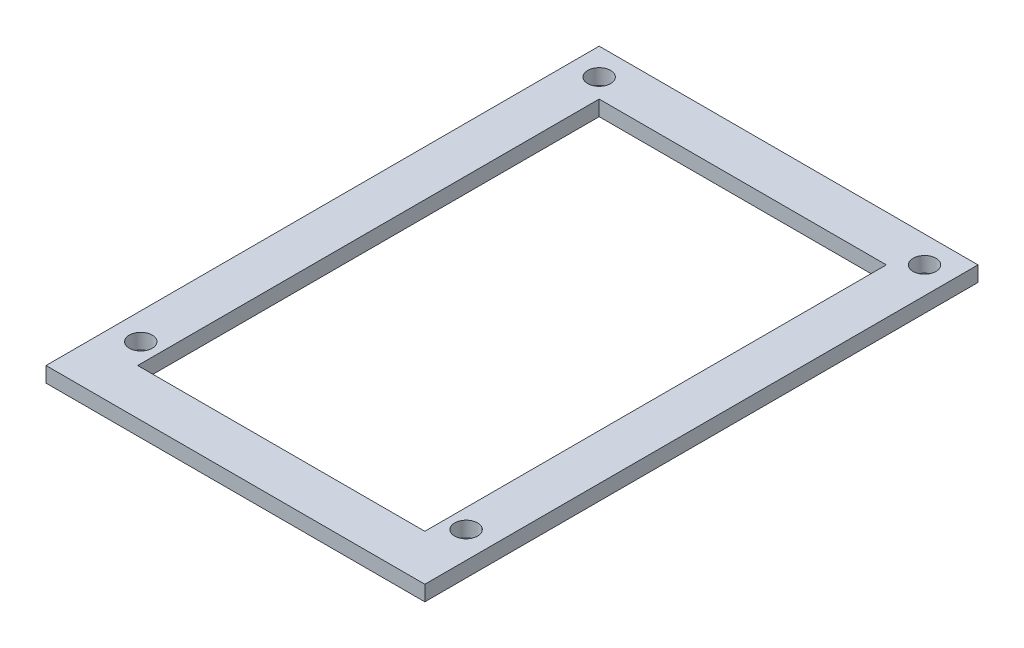
ISO-10303-21;
HEADER;
FILE_DESCRIPTION(('STEP AP214'),'2;1');
FILE_NAME('part.step','',(''),(''),'','','');
FILE_SCHEMA(('AUTOMOTIVE_DESIGN { 1 0 10303 214 1 1 1 1 }'));
ENDSEC;
DATA;
#1=APPLICATION_CONTEXT('core data for automotive mechanical design processes');
#2=APPLICATION_PROTOCOL_DEFINITION('international standard','automotive_design',2000,#1);
#3=PRODUCT_CONTEXT('',#1,'mechanical');
#4=PRODUCT('Part','Part','',(#3));
#5=PRODUCT_RELATED_PRODUCT_CATEGORY('part','',(#4));
#6=PRODUCT_DEFINITION_FORMATION('','',#4);
#7=PRODUCT_DEFINITION_CONTEXT('part definition',#1,'design');
#8=PRODUCT_DEFINITION('design','',#6,#7);
#9=PRODUCT_DEFINITION_SHAPE('','',#8);
#10=(LENGTH_UNIT() NAMED_UNIT(*) SI_UNIT(.MILLI.,.METRE.));
#11=(NAMED_UNIT(*) PLANE_ANGLE_UNIT() SI_UNIT($,.RADIAN.));
#12=(NAMED_UNIT(*) SI_UNIT($,.STERADIAN.) SOLID_ANGLE_UNIT());
#13=UNCERTAINTY_MEASURE_WITH_UNIT(LENGTH_MEASURE(1.E-05),#10,'distance_accuracy_value','');
#14=(GEOMETRIC_REPRESENTATION_CONTEXT(3) GLOBAL_UNCERTAINTY_ASSIGNED_CONTEXT((#13)) GLOBAL_UNIT_ASSIGNED_CONTEXT((#10,
#11,#12)) REPRESENTATION_CONTEXT('',''));
#15=CARTESIAN_POINT('',(0.,0.,0.));
#16=DIRECTION('',(0.,0.,1.));
#17=DIRECTION('',(1.,0.,0.));
#18=AXIS2_PLACEMENT_3D('',#15,#16,#17);
#19=CARTESIAN_POINT('',(0.,1.5875,0.));
#20=DIRECTION('',(0.,1.,0.));
#21=DIRECTION('',(0.,0.,1.));
#22=AXIS2_PLACEMENT_3D('',#19,#20,#21);
#23=PLANE('',#22);
#24=CARTESIAN_POINT('',(36.58096070189,1.5875,-7.06729553665104));
#25=DIRECTION('',(0.,1.,0.));
#26=DIRECTION('',(0.,0.,1.));
#27=AXIS2_PLACEMENT_3D('',#24,#25,#26);
#28=CIRCLE('',#27,1.190625);
#29=CARTESIAN_POINT('',(36.58096070189,1.5875,-5.87667053665104));
#30=VERTEX_POINT('',#29);
#31=EDGE_CURVE('E399',#30,#30,#28,.T.);
#32=ORIENTED_EDGE('',*,*,#31,.F.);
#33=EDGE_LOOP('',(#32));
#34=FACE_BOUND('',#33,.T.);
#35=CARTESIAN_POINT('',(2.778125,1.5875,-54.692295536651));
#36=DIRECTION('',(0.,1.,0.));
#37=DIRECTION('',(0.,0.,1.));
#38=AXIS2_PLACEMENT_3D('',#35,#36,#37);
#39=CIRCLE('',#38,1.190625);
#40=CARTESIAN_POINT('',(2.778125,1.5875,-53.501670536651));
#41=VERTEX_POINT('',#40);
#42=EDGE_CURVE('E144',#41,#41,#39,.T.);
#43=ORIENTED_EDGE('',*,*,#42,.F.);
#44=EDGE_LOOP('',(#43));
#45=FACE_BOUND('',#44,.T.);
#46=DIRECTION('',(0.,0.,-1.));
#47=VECTOR('',#46,1.);
#48=CARTESIAN_POINT('',(39.35908570189,1.5875,-57.470420536651));
#49=LINE('',#48,#47);
#50=CARTESIAN_POINT('',(39.35908570189,1.5875,0.));
#51=VERTEX_POINT('',#50);
#52=CARTESIAN_POINT('',(39.35908570189,1.5875,-57.470420536651));
#53=VERTEX_POINT('',#52);
#54=EDGE_CURVE('E160',#51,#53,#49,.T.);
#55=ORIENTED_EDGE('',*,*,#54,.T.);
#56=DIRECTION('',(-1.,0.,0.));
#57=VECTOR('',#56,1.);
#58=CARTESIAN_POINT('',(0.,1.5875,-57.470420536651));
#59=LINE('',#58,#57);
#60=CARTESIAN_POINT('',(0.,1.5875,-57.470420536651));
#61=VERTEX_POINT('',#60);
#62=EDGE_CURVE('E164',#53,#61,#59,.T.);
#63=ORIENTED_EDGE('',*,*,#62,.T.);
#64=DIRECTION('',(0.,0.,1.));
#65=VECTOR('',#64,1.);
#66=CARTESIAN_POINT('',(0.,1.5875,-54.692295536651));
#67=LINE('',#66,#65);
#68=CARTESIAN_POINT('',(0.,1.5875,0.));
#69=VERTEX_POINT('',#68);
#70=EDGE_CURVE('E168',#61,#69,#67,.T.);
#71=ORIENTED_EDGE('',*,*,#70,.T.);
#72=DIRECTION('',(1.,0.,0.));
#73=VECTOR('',#72,1.);
#74=CARTESIAN_POINT('',(0.,1.5875,0.));
#75=LINE('',#74,#73);
#76=EDGE_CURVE('E171',#69,#51,#75,.T.);
#77=ORIENTED_EDGE('',*,*,#76,.T.);
#78=EDGE_LOOP('',(#55,#63,#71,#77));
#79=FACE_BOUND('',#78,.T.);
#80=DIRECTION('',(0.,0.,1.));
#81=VECTOR('',#80,1.);
#82=CARTESIAN_POINT('',(4.7625,1.5875,-52.7079205366511));
#83=LINE('',#82,#81);
#84=CARTESIAN_POINT('',(4.7625,1.5875,-52.7079205366511));
#85=VERTEX_POINT('',#84);
#86=CARTESIAN_POINT('',(4.7625,1.5875,-4.7625));
#87=VERTEX_POINT('',#86);
#88=EDGE_CURVE('E118',#85,#87,#83,.T.);
#89=ORIENTED_EDGE('',*,*,#88,.F.);
#90=DIRECTION('',(-1.,0.,0.));
#91=VECTOR('',#90,1.);
#92=CARTESIAN_POINT('',(4.7625,1.5875,-52.7079205366511));
#93=LINE('',#92,#91);
#94=CARTESIAN_POINT('',(34.59658570189,1.5875,-52.7079205366511));
#95=VERTEX_POINT('',#94);
#96=EDGE_CURVE('E109',#95,#85,#93,.T.);
#97=ORIENTED_EDGE('',*,*,#96,.F.);
#98=DIRECTION('',(0.,0.,-1.));
#99=VECTOR('',#98,1.);
#100=CARTESIAN_POINT('',(34.59658570189,1.5875,-7.06729553665104));
#101=LINE('',#100,#99);
#102=CARTESIAN_POINT('',(34.59658570189,1.5875,-4.7625));
#103=VERTEX_POINT('',#102);
#104=EDGE_CURVE('E136',#103,#95,#101,.T.);
#105=ORIENTED_EDGE('',*,*,#104,.F.);
#106=DIRECTION('',(1.,0.,0.));
#107=VECTOR('',#106,1.);
#108=CARTESIAN_POINT('',(4.7625,1.5875,-4.7625));
#109=LINE('',#108,#107);
#110=EDGE_CURVE('E132',#87,#103,#109,.T.);
#111=ORIENTED_EDGE('',*,*,#110,.F.);
#112=EDGE_LOOP('',(#89,#97,#105,#111));
#113=FACE_BOUND('',#112,.T.);
#114=CARTESIAN_POINT('',(36.58096070189,1.5875,-54.692295536651));
#115=DIRECTION('',(0.,1.,0.));
#116=DIRECTION('',(0.,0.,1.));
#117=AXIS2_PLACEMENT_3D('',#114,#115,#116);
#118=CIRCLE('',#117,1.190625);
#119=CARTESIAN_POINT('',(36.58096070189,1.5875,-53.501670536651));
#120=VERTEX_POINT('',#119);
#121=EDGE_CURVE('E407',#120,#120,#118,.T.);
#122=ORIENTED_EDGE('',*,*,#121,.F.);
#123=EDGE_LOOP('',(#122));
#124=FACE_BOUND('',#123,.T.);
#125=CARTESIAN_POINT('',(2.778125,1.5875,-7.06729553665104));
#126=DIRECTION('',(0.,1.,0.));
#127=DIRECTION('',(0.,0.,1.));
#128=AXIS2_PLACEMENT_3D('',#125,#126,#127);
#129=CIRCLE('',#128,1.190625);
#130=CARTESIAN_POINT('',(2.778125,1.5875,-5.87667053665104));
#131=VERTEX_POINT('',#130);
#132=EDGE_CURVE('E388',#131,#131,#129,.T.);
#133=ORIENTED_EDGE('',*,*,#132,.F.);
#134=EDGE_LOOP('',(#133));
#135=FACE_BOUND('',#134,.T.);
#136=ADVANCED_FACE('F43',(#34,#45,#79,#113,#124,#135),#23,.T.);
#137=CARTESIAN_POINT('',(0.,0.,0.));
#138=DIRECTION('',(0.,1.,0.));
#139=DIRECTION('',(0.,0.,1.));
#140=AXIS2_PLACEMENT_3D('',#137,#138,#139);
#141=PLANE('',#140);
#142=DIRECTION('',(-1.,0.,0.));
#143=VECTOR('',#142,1.);
#144=CARTESIAN_POINT('',(0.,0.,-57.470420536651));
#145=LINE('',#144,#143);
#146=CARTESIAN_POINT('',(39.35908570189,0.,-57.470420536651));
#147=VERTEX_POINT('',#146);
#148=CARTESIAN_POINT('',(0.,0.,-57.470420536651));
#149=VERTEX_POINT('',#148);
#150=EDGE_CURVE('E127',#147,#149,#145,.T.);
#151=ORIENTED_EDGE('',*,*,#150,.F.);
#152=DIRECTION('',(0.,0.,-1.));
#153=VECTOR('',#152,1.);
#154=CARTESIAN_POINT('',(39.35908570189,0.,-54.692295536651));
#155=LINE('',#154,#153);
#156=CARTESIAN_POINT('',(39.35908570189,0.,0.));
#157=VERTEX_POINT('',#156);
#158=EDGE_CURVE('E165',#157,#147,#155,.T.);
#159=ORIENTED_EDGE('',*,*,#158,.F.);
#160=DIRECTION('',(1.,0.,0.));
#161=VECTOR('',#160,1.);
#162=CARTESIAN_POINT('',(0.,0.,0.));
#163=LINE('',#162,#161);
#164=CARTESIAN_POINT('',(0.,0.,0.));
#165=VERTEX_POINT('',#164);
#166=EDGE_CURVE('E182',#165,#157,#163,.T.);
#167=ORIENTED_EDGE('',*,*,#166,.F.);
#168=DIRECTION('',(0.,0.,1.));
#169=VECTOR('',#168,1.);
#170=CARTESIAN_POINT('',(0.,0.,-7.06729553665104));
#171=LINE('',#170,#169);
#172=EDGE_CURVE('E179',#149,#165,#171,.T.);
#173=ORIENTED_EDGE('',*,*,#172,.F.);
#174=EDGE_LOOP('',(#151,#159,#167,#173));
#175=FACE_BOUND('',#174,.T.);
#176=DIRECTION('',(-1.,0.,0.));
#177=VECTOR('',#176,1.);
#178=CARTESIAN_POINT('',(4.7625,0.,-52.7079205366511));
#179=LINE('',#178,#177);
#180=CARTESIAN_POINT('',(34.59658570189,0.,-52.7079205366511));
#181=VERTEX_POINT('',#180);
#182=CARTESIAN_POINT('',(4.7625,0.,-52.7079205366511));
#183=VERTEX_POINT('',#182);
#184=EDGE_CURVE('E67',#181,#183,#179,.T.);
#185=ORIENTED_EDGE('',*,*,#184,.T.);
#186=DIRECTION('',(0.,0.,1.));
#187=VECTOR('',#186,1.);
#188=CARTESIAN_POINT('',(4.7625,0.,-7.06729553665104));
#189=LINE('',#188,#187);
#190=CARTESIAN_POINT('',(4.7625,0.,-4.7625));
#191=VERTEX_POINT('',#190);
#192=EDGE_CURVE('E125',#183,#191,#189,.T.);
#193=ORIENTED_EDGE('',*,*,#192,.T.);
#194=DIRECTION('',(1.,0.,0.));
#195=VECTOR('',#194,1.);
#196=CARTESIAN_POINT('',(4.7625,0.,-4.7625));
#197=LINE('',#196,#195);
#198=CARTESIAN_POINT('',(34.59658570189,0.,-4.7625));
#199=VERTEX_POINT('',#198);
#200=EDGE_CURVE('E147',#191,#199,#197,.T.);
#201=ORIENTED_EDGE('',*,*,#200,.T.);
#202=DIRECTION('',(0.,0.,-1.));
#203=VECTOR('',#202,1.);
#204=CARTESIAN_POINT('',(34.59658570189,0.,-52.7079205366511));
#205=LINE('',#204,#203);
#206=EDGE_CURVE('E119',#199,#181,#205,.T.);
#207=ORIENTED_EDGE('',*,*,#206,.T.);
#208=EDGE_LOOP('',(#185,#193,#201,#207));
#209=FACE_BOUND('',#208,.T.);
#210=CARTESIAN_POINT('',(2.778125,0.,-54.692295536651));
#211=DIRECTION('',(0.,1.,0.));
#212=DIRECTION('',(0.,0.,1.));
#213=AXIS2_PLACEMENT_3D('',#210,#211,#212);
#214=CIRCLE('',#213,1.190625);
#215=CARTESIAN_POINT('',(2.778125,0.,-53.501670536651));
#216=VERTEX_POINT('',#215);
#217=EDGE_CURVE('E411',#216,#216,#214,.T.);
#218=ORIENTED_EDGE('',*,*,#217,.T.);
#219=EDGE_LOOP('',(#218));
#220=FACE_BOUND('',#219,.T.);
#221=CARTESIAN_POINT('',(36.58096070189,0.,-54.692295536651));
#222=DIRECTION('',(0.,1.,0.));
#223=DIRECTION('',(0.,0.,1.));
#224=AXIS2_PLACEMENT_3D('',#221,#222,#223);
#225=CIRCLE('',#224,1.190625);
#226=CARTESIAN_POINT('',(36.58096070189,0.,-53.501670536651));
#227=VERTEX_POINT('',#226);
#228=EDGE_CURVE('E403',#227,#227,#225,.T.);
#229=ORIENTED_EDGE('',*,*,#228,.T.);
#230=EDGE_LOOP('',(#229));
#231=FACE_BOUND('',#230,.T.);
#232=CARTESIAN_POINT('',(36.58096070189,0.,-7.06729553665104));
#233=DIRECTION('',(0.,1.,0.));
#234=DIRECTION('',(0.,0.,1.));
#235=AXIS2_PLACEMENT_3D('',#232,#233,#234);
#236=CIRCLE('',#235,1.190625);
#237=CARTESIAN_POINT('',(36.58096070189,0.,-5.87667053665104));
#238=VERTEX_POINT('',#237);
#239=EDGE_CURVE('E396',#238,#238,#236,.T.);
#240=ORIENTED_EDGE('',*,*,#239,.T.);
#241=EDGE_LOOP('',(#240));
#242=FACE_BOUND('',#241,.T.);
#243=CARTESIAN_POINT('',(2.778125,0.,-7.06729553665104));
#244=DIRECTION('',(0.,1.,0.));
#245=DIRECTION('',(0.,0.,1.));
#246=AXIS2_PLACEMENT_3D('',#243,#244,#245);
#247=CIRCLE('',#246,1.190625);
#248=CARTESIAN_POINT('',(2.778125,0.,-5.87667053665104));
#249=VERTEX_POINT('',#248);
#250=EDGE_CURVE('E391',#249,#249,#247,.T.);
#251=ORIENTED_EDGE('',*,*,#250,.T.);
#252=EDGE_LOOP('',(#251));
#253=FACE_BOUND('',#252,.T.);
#254=ADVANCED_FACE('F205',(#175,#209,#220,#231,#242,#253),#141,.F.);
#255=CARTESIAN_POINT('',(0.,1.5875,-57.470420536651));
#256=DIRECTION('',(0.,0.,1.));
#257=DIRECTION('',(1.,0.,0.));
#258=AXIS2_PLACEMENT_3D('',#255,#256,#257);
#259=PLANE('',#258);
#260=ORIENTED_EDGE('',*,*,#150,.T.);
#261=DIRECTION('',(0.,-1.,0.));
#262=VECTOR('',#261,1.);
#263=CARTESIAN_POINT('',(0.,1.5875,-57.470420536651));
#264=LINE('',#263,#262);
#265=EDGE_CURVE('E52',#61,#149,#264,.T.);
#266=ORIENTED_EDGE('',*,*,#265,.F.);
#267=ORIENTED_EDGE('',*,*,#62,.F.);
#268=DIRECTION('',(0.,-1.,0.));
#269=VECTOR('',#268,1.);
#270=CARTESIAN_POINT('',(39.35908570189,1.5875,-57.470420536651));
#271=LINE('',#270,#269);
#272=EDGE_CURVE('E11',#53,#147,#271,.T.);
#273=ORIENTED_EDGE('',*,*,#272,.T.);
#274=EDGE_LOOP('',(#260,#266,#267,#273));
#275=FACE_BOUND('',#274,.T.);
#276=ADVANCED_FACE('F45',(#275),#259,.F.);
#277=CARTESIAN_POINT('',(0.,1.5875,-7.06729553665104));
#278=DIRECTION('',(1.,0.,0.));
#279=DIRECTION('',(0.,0.,-1.));
#280=AXIS2_PLACEMENT_3D('',#277,#278,#279);
#281=PLANE('',#280);
#282=ORIENTED_EDGE('',*,*,#172,.T.);
#283=DIRECTION('',(0.,-1.,0.));
#284=VECTOR('',#283,1.);
#285=CARTESIAN_POINT('',(0.,1.5875,0.));
#286=LINE('',#285,#284);
#287=EDGE_CURVE('E191',#69,#165,#286,.T.);
#288=ORIENTED_EDGE('',*,*,#287,.F.);
#289=ORIENTED_EDGE('',*,*,#70,.F.);
#290=ORIENTED_EDGE('',*,*,#265,.T.);
#291=EDGE_LOOP('',(#282,#288,#289,#290));
#292=FACE_BOUND('',#291,.T.);
#293=ADVANCED_FACE('F199',(#292),#281,.F.);
#294=CARTESIAN_POINT('',(0.,1.5875,0.));
#295=DIRECTION('',(0.,0.,-1.));
#296=DIRECTION('',(-1.,0.,0.));
#297=AXIS2_PLACEMENT_3D('',#294,#295,#296);
#298=PLANE('',#297);
#299=ORIENTED_EDGE('',*,*,#166,.T.);
#300=DIRECTION('',(0.,-1.,0.));
#301=VECTOR('',#300,1.);
#302=CARTESIAN_POINT('',(39.35908570189,1.5875,0.));
#303=LINE('',#302,#301);
#304=EDGE_CURVE('E175',#51,#157,#303,.T.);
#305=ORIENTED_EDGE('',*,*,#304,.F.);
#306=ORIENTED_EDGE('',*,*,#76,.F.);
#307=ORIENTED_EDGE('',*,*,#287,.T.);
#308=EDGE_LOOP('',(#299,#305,#306,#307));
#309=FACE_BOUND('',#308,.T.);
#310=ADVANCED_FACE('F210',(#309),#298,.F.);
#311=CARTESIAN_POINT('',(39.35908570189,1.5875,-54.692295536651));
#312=DIRECTION('',(-1.,0.,0.));
#313=DIRECTION('',(0.,0.,1.));
#314=AXIS2_PLACEMENT_3D('',#311,#312,#313);
#315=PLANE('',#314);
#316=ORIENTED_EDGE('',*,*,#158,.T.);
#317=ORIENTED_EDGE('',*,*,#272,.F.);
#318=ORIENTED_EDGE('',*,*,#54,.F.);
#319=ORIENTED_EDGE('',*,*,#304,.T.);
#320=EDGE_LOOP('',(#316,#317,#318,#319));
#321=FACE_BOUND('',#320,.T.);
#322=ADVANCED_FACE('F213',(#321),#315,.F.);
#323=CARTESIAN_POINT('',(4.7625,1.5875,-52.7079205366511));
#324=DIRECTION('',(0.,0.,1.));
#325=DIRECTION('',(1.,0.,0.));
#326=AXIS2_PLACEMENT_3D('',#323,#324,#325);
#327=PLANE('',#326);
#328=ORIENTED_EDGE('',*,*,#184,.F.);
#329=DIRECTION('',(0.,-1.,0.));
#330=VECTOR('',#329,1.);
#331=CARTESIAN_POINT('',(34.59658570189,1.5875,-52.7079205366511));
#332=LINE('',#331,#330);
#333=EDGE_CURVE('E113',#95,#181,#332,.T.);
#334=ORIENTED_EDGE('',*,*,#333,.F.);
#335=ORIENTED_EDGE('',*,*,#96,.T.);
#336=DIRECTION('',(0.,-1.,0.));
#337=VECTOR('',#336,1.);
#338=CARTESIAN_POINT('',(4.7625,1.5875,-52.7079205366511));
#339=LINE('',#338,#337);
#340=EDGE_CURVE('E112',#85,#183,#339,.T.);
#341=ORIENTED_EDGE('',*,*,#340,.T.);
#342=EDGE_LOOP('',(#328,#334,#335,#341));
#343=FACE_BOUND('',#342,.T.);
#344=ADVANCED_FACE('F111',(#343),#327,.T.);
#345=CARTESIAN_POINT('',(4.7625,1.5875,-7.06729553665104));
#346=DIRECTION('',(1.,0.,0.));
#347=DIRECTION('',(0.,0.,-1.));
#348=AXIS2_PLACEMENT_3D('',#345,#346,#347);
#349=PLANE('',#348);
#350=ORIENTED_EDGE('',*,*,#192,.F.);
#351=ORIENTED_EDGE('',*,*,#340,.F.);
#352=ORIENTED_EDGE('',*,*,#88,.T.);
#353=DIRECTION('',(0.,-1.,0.));
#354=VECTOR('',#353,1.);
#355=CARTESIAN_POINT('',(4.7625,1.5875,-4.7625));
#356=LINE('',#355,#354);
#357=EDGE_CURVE('E128',#87,#191,#356,.T.);
#358=ORIENTED_EDGE('',*,*,#357,.T.);
#359=EDGE_LOOP('',(#350,#351,#352,#358));
#360=FACE_BOUND('',#359,.T.);
#361=ADVANCED_FACE('F122',(#360),#349,.T.);
#362=CARTESIAN_POINT('',(4.7625,1.5875,-4.7625));
#363=DIRECTION('',(0.,0.,-1.));
#364=DIRECTION('',(-1.,0.,0.));
#365=AXIS2_PLACEMENT_3D('',#362,#363,#364);
#366=PLANE('',#365);
#367=ORIENTED_EDGE('',*,*,#200,.F.);
#368=ORIENTED_EDGE('',*,*,#357,.F.);
#369=ORIENTED_EDGE('',*,*,#110,.T.);
#370=DIRECTION('',(0.,-1.,0.));
#371=VECTOR('',#370,1.);
#372=CARTESIAN_POINT('',(34.59658570189,1.5875,-4.7625));
#373=LINE('',#372,#371);
#374=EDGE_CURVE('E59',#103,#199,#373,.T.);
#375=ORIENTED_EDGE('',*,*,#374,.T.);
#376=EDGE_LOOP('',(#367,#368,#369,#375));
#377=FACE_BOUND('',#376,.T.);
#378=ADVANCED_FACE('F288',(#377),#366,.T.);
#379=CARTESIAN_POINT('',(34.59658570189,1.5875,-52.7079205366511));
#380=DIRECTION('',(-1.,0.,0.));
#381=DIRECTION('',(0.,0.,1.));
#382=AXIS2_PLACEMENT_3D('',#379,#380,#381);
#383=PLANE('',#382);
#384=ORIENTED_EDGE('',*,*,#206,.F.);
#385=ORIENTED_EDGE('',*,*,#374,.F.);
#386=ORIENTED_EDGE('',*,*,#104,.T.);
#387=ORIENTED_EDGE('',*,*,#333,.T.);
#388=EDGE_LOOP('',(#384,#385,#386,#387));
#389=FACE_BOUND('',#388,.T.);
#390=ADVANCED_FACE('F296',(#389),#383,.T.);
#391=CARTESIAN_POINT('',(2.778125,1.5875,-54.692295536651));
#392=DIRECTION('',(0.,-1.,0.));
#393=DIRECTION('',(0.,0.,-1.));
#394=AXIS2_PLACEMENT_3D('',#391,#392,#393);
#395=CYLINDRICAL_SURFACE('',#394,1.190625);
#396=ORIENTED_EDGE('',*,*,#42,.T.);
#397=EDGE_LOOP('',(#396));
#398=FACE_BOUND('',#397,.T.);
#399=ORIENTED_EDGE('',*,*,#217,.F.);
#400=EDGE_LOOP('',(#399));
#401=FACE_BOUND('',#400,.T.);
#402=ADVANCED_FACE('F306',(#398,#401),#395,.F.);
#403=CARTESIAN_POINT('',(36.58096070189,1.5875,-54.692295536651));
#404=DIRECTION('',(0.,-1.,0.));
#405=DIRECTION('',(0.,0.,-1.));
#406=AXIS2_PLACEMENT_3D('',#403,#404,#405);
#407=CYLINDRICAL_SURFACE('',#406,1.190625);
#408=ORIENTED_EDGE('',*,*,#121,.T.);
#409=EDGE_LOOP('',(#408));
#410=FACE_BOUND('',#409,.T.);
#411=ORIENTED_EDGE('',*,*,#228,.F.);
#412=EDGE_LOOP('',(#411));
#413=FACE_BOUND('',#412,.T.);
#414=ADVANCED_FACE('F315',(#410,#413),#407,.F.);
#415=CARTESIAN_POINT('',(36.58096070189,1.5875,-7.06729553665104));
#416=DIRECTION('',(0.,-1.,0.));
#417=DIRECTION('',(0.,0.,-1.));
#418=AXIS2_PLACEMENT_3D('',#415,#416,#417);
#419=CYLINDRICAL_SURFACE('',#418,1.190625);
#420=ORIENTED_EDGE('',*,*,#31,.T.);
#421=EDGE_LOOP('',(#420));
#422=FACE_BOUND('',#421,.T.);
#423=ORIENTED_EDGE('',*,*,#239,.F.);
#424=EDGE_LOOP('',(#423));
#425=FACE_BOUND('',#424,.T.);
#426=ADVANCED_FACE('F325',(#422,#425),#419,.F.);
#427=CARTESIAN_POINT('',(2.778125,1.5875,-7.06729553665104));
#428=DIRECTION('',(0.,-1.,0.));
#429=DIRECTION('',(0.,0.,-1.));
#430=AXIS2_PLACEMENT_3D('',#427,#428,#429);
#431=CYLINDRICAL_SURFACE('',#430,1.190625);
#432=ORIENTED_EDGE('',*,*,#132,.T.);
#433=EDGE_LOOP('',(#432));
#434=FACE_BOUND('',#433,.T.);
#435=ORIENTED_EDGE('',*,*,#250,.F.);
#436=EDGE_LOOP('',(#435));
#437=FACE_BOUND('',#436,.T.);
#438=ADVANCED_FACE('F335',(#434,#437),#431,.F.);
#439=CLOSED_SHELL('',(#136,#254,#276,#293,#310,#322,#344,#361,#378,#390,#402,#414,#426,#438));
#440=MANIFOLD_SOLID_BREP('B2',#439);
#441=ADVANCED_BREP_SHAPE_REPRESENTATION('',(#18,#440),#14);
#442=SHAPE_DEFINITION_REPRESENTATION(#9,#441);
ENDSEC;
END-ISO-10303-21;
